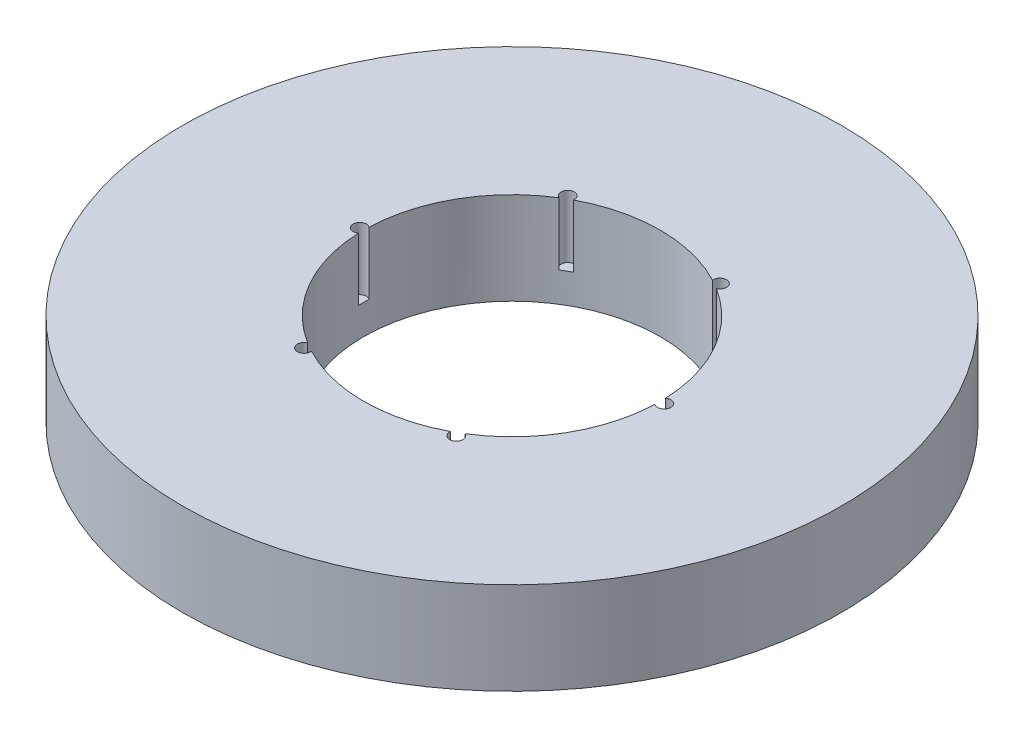
ISO-10303-21;
HEADER;
FILE_DESCRIPTION(('STEP AP214'),'2;1');
FILE_NAME('part.step','',(''),(''),'','','');
FILE_SCHEMA(('AUTOMOTIVE_DESIGN { 1 0 10303 214 1 1 1 1 }'));
ENDSEC;
DATA;
#1=APPLICATION_CONTEXT('core data for automotive mechanical design processes');
#2=APPLICATION_PROTOCOL_DEFINITION('international standard','automotive_design',2000,#1);
#3=PRODUCT_CONTEXT('',#1,'mechanical');
#4=PRODUCT('Part','Part','',(#3));
#5=PRODUCT_RELATED_PRODUCT_CATEGORY('part','',(#4));
#6=PRODUCT_DEFINITION_FORMATION('','',#4);
#7=PRODUCT_DEFINITION_CONTEXT('part definition',#1,'design');
#8=PRODUCT_DEFINITION('design','',#6,#7);
#9=PRODUCT_DEFINITION_SHAPE('','',#8);
#10=(LENGTH_UNIT() NAMED_UNIT(*) SI_UNIT(.MILLI.,.METRE.));
#11=(NAMED_UNIT(*) PLANE_ANGLE_UNIT() SI_UNIT($,.RADIAN.));
#12=(NAMED_UNIT(*) SI_UNIT($,.STERADIAN.) SOLID_ANGLE_UNIT());
#13=UNCERTAINTY_MEASURE_WITH_UNIT(LENGTH_MEASURE(1.E-05),#10,'distance_accuracy_value','');
#14=(GEOMETRIC_REPRESENTATION_CONTEXT(3) GLOBAL_UNCERTAINTY_ASSIGNED_CONTEXT((#13)) GLOBAL_UNIT_ASSIGNED_CONTEXT((#10,
#11,#12)) REPRESENTATION_CONTEXT('',''));
#15=CARTESIAN_POINT('',(0.,0.,0.));
#16=DIRECTION('',(0.,0.,1.));
#17=DIRECTION('',(1.,0.,0.));
#18=AXIS2_PLACEMENT_3D('',#15,#16,#17);
#19=CARTESIAN_POINT('',(0.,28.,0.));
#20=DIRECTION('',(0.,-1.,0.));
#21=DIRECTION('',(0.,0.,-1.));
#22=AXIS2_PLACEMENT_3D('',#19,#20,#21);
#23=CYLINDRICAL_SURFACE('',#22,100.);
#24=CARTESIAN_POINT('',(0.,28.,0.));
#25=DIRECTION('',(0.,1.,0.));
#26=DIRECTION('',(0.,0.,1.));
#27=AXIS2_PLACEMENT_3D('',#24,#25,#26);
#28=CIRCLE('',#27,100.);
#29=CARTESIAN_POINT('',(0.,28.,100.));
#30=VERTEX_POINT('',#29);
#31=EDGE_CURVE('E171',#30,#30,#28,.T.);
#32=ORIENTED_EDGE('',*,*,#31,.F.);
#33=EDGE_LOOP('',(#32));
#34=FACE_BOUND('',#33,.T.);
#35=CARTESIAN_POINT('',(0.,0.,0.));
#36=DIRECTION('',(0.,1.,0.));
#37=DIRECTION('',(0.,0.,1.));
#38=AXIS2_PLACEMENT_3D('',#35,#36,#37);
#39=CIRCLE('',#38,100.);
#40=CARTESIAN_POINT('',(0.,0.,100.));
#41=VERTEX_POINT('',#40);
#42=EDGE_CURVE('E157',#41,#41,#39,.T.);
#43=ORIENTED_EDGE('',*,*,#42,.T.);
#44=EDGE_LOOP('',(#43));
#45=FACE_BOUND('',#44,.T.);
#46=ADVANCED_FACE('F39',(#34,#45),#23,.T.);
#47=CARTESIAN_POINT('',(0.,28.,0.));
#48=DIRECTION('',(0.,1.,0.));
#49=DIRECTION('',(0.,0.,1.));
#50=AXIS2_PLACEMENT_3D('',#47,#48,#49);
#51=PLANE('',#50);
#52=CARTESIAN_POINT('',(-23.097180607275,28.,-40.0054903233939));
#53=DIRECTION('',(0.,1.,0.));
#54=DIRECTION('',(-0.866025403784433,0.,0.50000000000001));
#55=AXIS2_PLACEMENT_3D('',#52,#53,#54);
#56=CIRCLE('',#55,2.01061830867234);
#57=CARTESIAN_POINT('',(-21.1035486993544,28.,-39.7446881016064));
#58=VERTEX_POINT('',#57);
#59=CARTESIAN_POINT('',(-23.8681352118039,28.,-38.1485533344457));
#60=VERTEX_POINT('',#59);
#61=EDGE_CURVE('E214',#58,#60,#56,.T.);
#62=ORIENTED_EDGE('',*,*,#61,.F.);
#63=CARTESIAN_POINT('',(0.,28.,0.));
#64=DIRECTION('',(0.,1.,0.));
#65=DIRECTION('',(0.,0.,1.));
#66=AXIS2_PLACEMENT_3D('',#63,#64,#65);
#67=CIRCLE('',#66,45.);
#68=CARTESIAN_POINT('',(21.1035486993536,28.,-39.7446881016069));
#69=VERTEX_POINT('',#68);
#70=EDGE_CURVE('E272',#69,#58,#67,.T.);
#71=ORIENTED_EDGE('',*,*,#70,.F.);
#72=CARTESIAN_POINT('',(23.0971806072742,28.,-40.0054903233944));
#73=DIRECTION('',(0.,1.,0.));
#74=DIRECTION('',(-0.866025403784443,0.,-0.499999999999992));
#75=AXIS2_PLACEMENT_3D('',#72,#73,#74);
#76=CIRCLE('',#75,2.01061830867234);
#77=CARTESIAN_POINT('',(23.8681352118031,28.,-38.1485533344462));
#78=VERTEX_POINT('',#77);
#79=EDGE_CURVE('E285',#78,#69,#76,.T.);
#80=ORIENTED_EDGE('',*,*,#79,.F.);
#81=CARTESIAN_POINT('',(44.9716839111575,28.,-1.59613476716074));
#82=VERTEX_POINT('',#81);
#83=EDGE_CURVE('E165',#82,#78,#67,.T.);
#84=ORIENTED_EDGE('',*,*,#83,.F.);
#85=CARTESIAN_POINT('',(46.1943612145492,28.,0.));
#86=DIRECTION('',(0.,1.,0.));
#87=DIRECTION('',(0.,0.,-1.));
#88=AXIS2_PLACEMENT_3D('',#85,#86,#87);
#89=CIRCLE('',#88,2.01061830867234);
#90=CARTESIAN_POINT('',(44.9716839111575,28.,1.59613476716074));
#91=VERTEX_POINT('',#90);
#92=EDGE_CURVE('E281',#91,#82,#89,.T.);
#93=ORIENTED_EDGE('',*,*,#92,.F.);
#94=CARTESIAN_POINT('',(23.8681352118037,28.,38.1485533344458));
#95=VERTEX_POINT('',#94);
#96=EDGE_CURVE('E160',#95,#91,#67,.T.);
#97=ORIENTED_EDGE('',*,*,#96,.F.);
#98=CARTESIAN_POINT('',(23.0971806072748,28.,40.005490323394));
#99=DIRECTION('',(0.,1.,0.));
#100=DIRECTION('',(0.866025403784436,0.,-0.500000000000004));
#101=AXIS2_PLACEMENT_3D('',#98,#99,#100);
#102=CIRCLE('',#101,2.01061830867234);
#103=CARTESIAN_POINT('',(21.1035486993542,28.,39.7446881016066));
#104=VERTEX_POINT('',#103);
#105=EDGE_CURVE('E154',#104,#95,#102,.T.);
#106=ORIENTED_EDGE('',*,*,#105,.F.);
#107=CARTESIAN_POINT('',(-21.1035486993539,28.,39.7446881016067));
#108=VERTEX_POINT('',#107);
#109=EDGE_CURVE('E150',#108,#104,#67,.T.);
#110=ORIENTED_EDGE('',*,*,#109,.F.);
#111=CARTESIAN_POINT('',(-23.0971806072745,28.,40.0054903233942));
#112=DIRECTION('',(0.,1.,0.));
#113=DIRECTION('',(0.86602540378444,0.,0.499999999999998));
#114=AXIS2_PLACEMENT_3D('',#111,#112,#113);
#115=CIRCLE('',#114,2.01061830867234);
#116=CARTESIAN_POINT('',(-23.8681352118034,28.,38.148553334446));
#117=VERTEX_POINT('',#116);
#118=EDGE_CURVE('E127',#117,#108,#115,.T.);
#119=ORIENTED_EDGE('',*,*,#118,.F.);
#120=CARTESIAN_POINT('',(-44.9716839111575,28.,1.59613476716074));
#121=VERTEX_POINT('',#120);
#122=EDGE_CURVE('E156',#121,#117,#67,.T.);
#123=ORIENTED_EDGE('',*,*,#122,.F.);
#124=CARTESIAN_POINT('',(-46.1943612145492,28.,0.));
#125=DIRECTION('',(0.,1.,0.));
#126=DIRECTION('',(0.,0.,1.));
#127=AXIS2_PLACEMENT_3D('',#124,#125,#126);
#128=CIRCLE('',#127,2.01061830867234);
#129=CARTESIAN_POINT('',(-44.9716839111575,28.,-1.59613476716074));
#130=VERTEX_POINT('',#129);
#131=EDGE_CURVE('E164',#130,#121,#128,.T.);
#132=ORIENTED_EDGE('',*,*,#131,.F.);
#133=EDGE_CURVE('E159',#60,#130,#67,.T.);
#134=ORIENTED_EDGE('',*,*,#133,.F.);
#135=EDGE_LOOP('',(#62,#71,#80,#84,#93,#97,#106,#110,#119,#123,#132,#134));
#136=FACE_BOUND('',#135,.T.);
#137=ORIENTED_EDGE('',*,*,#31,.T.);
#138=EDGE_LOOP('',(#137));
#139=FACE_BOUND('',#138,.T.);
#140=ADVANCED_FACE('F155',(#136,#139),#51,.T.);
#141=CARTESIAN_POINT('',(0.,0.,0.));
#142=DIRECTION('',(0.,1.,0.));
#143=DIRECTION('',(0.,0.,1.));
#144=AXIS2_PLACEMENT_3D('',#141,#142,#143);
#145=PLANE('',#144);
#146=CARTESIAN_POINT('',(0.,0.,0.));
#147=DIRECTION('',(0.,1.,0.));
#148=DIRECTION('',(0.,0.,1.));
#149=AXIS2_PLACEMENT_3D('',#146,#147,#148);
#150=CIRCLE('',#149,45.);
#151=CARTESIAN_POINT('',(0.,0.,45.));
#152=VERTEX_POINT('',#151);
#153=EDGE_CURVE('E170',#152,#152,#150,.T.);
#154=ORIENTED_EDGE('',*,*,#153,.T.);
#155=EDGE_LOOP('',(#154));
#156=FACE_BOUND('',#155,.T.);
#157=ORIENTED_EDGE('',*,*,#42,.F.);
#158=EDGE_LOOP('',(#157));
#159=FACE_BOUND('',#158,.T.);
#160=ADVANCED_FACE('F232',(#156,#159),#145,.F.);
#161=CARTESIAN_POINT('',(0.,28.,0.));
#162=DIRECTION('',(0.,-1.,0.));
#163=DIRECTION('',(0.,0.,-1.));
#164=AXIS2_PLACEMENT_3D('',#161,#162,#163);
#165=CYLINDRICAL_SURFACE('',#164,45.);
#166=DIRECTION('',(0.,1.,0.));
#167=VECTOR('',#166,1.);
#168=CARTESIAN_POINT('',(-21.1035486993544,18.503757817113,-39.7446881016065));
#169=LINE('',#168,#167);
#170=CARTESIAN_POINT('',(-21.1035486993544,9.00751563422606,-39.7446881016064));
#171=VERTEX_POINT('',#170);
#172=EDGE_CURVE('E11',#171,#58,#169,.T.);
#173=ORIENTED_EDGE('',*,*,#172,.F.);
#174=CARTESIAN_POINT('',(0.,9.00751563422606,0.));
#175=DIRECTION('',(0.,1.,0.));
#176=DIRECTION('',(0.,0.,1.));
#177=AXIS2_PLACEMENT_3D('',#174,#175,#176);
#178=CIRCLE('',#177,45.);
#179=CARTESIAN_POINT('',(-23.8681352118039,9.00751563422606,-38.1485533344457));
#180=VERTEX_POINT('',#179);
#181=EDGE_CURVE('E209',#171,#180,#178,.T.);
#182=ORIENTED_EDGE('',*,*,#181,.T.);
#183=DIRECTION('',(0.,1.,0.));
#184=VECTOR('',#183,1.);
#185=CARTESIAN_POINT('',(-23.8681352118041,18.503757817113,-38.1485533344457));
#186=LINE('',#185,#184);
#187=EDGE_CURVE('E46',#60,#180,#186,.F.);
#188=ORIENTED_EDGE('',*,*,#187,.F.);
#189=ORIENTED_EDGE('',*,*,#133,.T.);
#190=DIRECTION('',(0.,1.,0.));
#191=VECTOR('',#190,1.);
#192=CARTESIAN_POINT('',(-44.9716839111576,18.503757817113,-1.5961347671608));
#193=LINE('',#192,#191);
#194=CARTESIAN_POINT('',(-44.9716839111575,9.00751563422606,-1.59613476716074));
#195=VERTEX_POINT('',#194);
#196=EDGE_CURVE('E185',#195,#130,#193,.T.);
#197=ORIENTED_EDGE('',*,*,#196,.F.);
#198=CARTESIAN_POINT('',(0.,9.00751563422606,0.));
#199=DIRECTION('',(0.,1.,0.));
#200=DIRECTION('',(0.,0.,1.));
#201=AXIS2_PLACEMENT_3D('',#198,#199,#200);
#202=CIRCLE('',#201,45.);
#203=CARTESIAN_POINT('',(-44.9716839111575,9.00751563422606,1.59613476716074));
#204=VERTEX_POINT('',#203);
#205=EDGE_CURVE('E173',#195,#204,#202,.T.);
#206=ORIENTED_EDGE('',*,*,#205,.T.);
#207=DIRECTION('',(0.,1.,0.));
#208=VECTOR('',#207,1.);
#209=CARTESIAN_POINT('',(-44.9716839111576,18.503757817113,1.5961347671608));
#210=LINE('',#209,#208);
#211=EDGE_CURVE('E178',#121,#204,#210,.F.);
#212=ORIENTED_EDGE('',*,*,#211,.F.);
#213=ORIENTED_EDGE('',*,*,#122,.T.);
#214=DIRECTION('',(0.,1.,0.));
#215=VECTOR('',#214,1.);
#216=CARTESIAN_POINT('',(-23.8681352118035,18.503757817113,38.148553334446));
#217=LINE('',#216,#215);
#218=CARTESIAN_POINT('',(-23.8681352118034,9.00751563422606,38.148553334446));
#219=VERTEX_POINT('',#218);
#220=EDGE_CURVE('E132',#219,#117,#217,.T.);
#221=ORIENTED_EDGE('',*,*,#220,.F.);
#222=CARTESIAN_POINT('',(0.,9.00751563422606,0.));
#223=DIRECTION('',(0.,1.,0.));
#224=DIRECTION('',(0.,0.,1.));
#225=AXIS2_PLACEMENT_3D('',#222,#223,#224);
#226=CIRCLE('',#225,45.);
#227=CARTESIAN_POINT('',(-21.1035486993539,9.00751563422606,39.7446881016067));
#228=VERTEX_POINT('',#227);
#229=EDGE_CURVE('E146',#219,#228,#226,.T.);
#230=ORIENTED_EDGE('',*,*,#229,.T.);
#231=DIRECTION('',(0.,1.,0.));
#232=VECTOR('',#231,1.);
#233=CARTESIAN_POINT('',(-21.1035486993539,18.503757817113,39.7446881016068));
#234=LINE('',#233,#232);
#235=EDGE_CURVE('E128',#108,#228,#234,.F.);
#236=ORIENTED_EDGE('',*,*,#235,.F.);
#237=ORIENTED_EDGE('',*,*,#109,.T.);
#238=DIRECTION('',(0.,1.,0.));
#239=VECTOR('',#238,1.);
#240=CARTESIAN_POINT('',(21.1035486993542,18.503757817113,39.7446881016065));
#241=LINE('',#240,#239);
#242=CARTESIAN_POINT('',(21.1035486993542,9.00751563422606,39.7446881016066));
#243=VERTEX_POINT('',#242);
#244=EDGE_CURVE('E192',#243,#104,#241,.T.);
#245=ORIENTED_EDGE('',*,*,#244,.F.);
#246=CARTESIAN_POINT('',(0.,9.00751563422606,0.));
#247=DIRECTION('',(0.,1.,0.));
#248=DIRECTION('',(0.,0.,1.));
#249=AXIS2_PLACEMENT_3D('',#246,#247,#248);
#250=CIRCLE('',#249,45.);
#251=CARTESIAN_POINT('',(23.8681352118037,9.00751563422606,38.1485533344458));
#252=VERTEX_POINT('',#251);
#253=EDGE_CURVE('E190',#243,#252,#250,.T.);
#254=ORIENTED_EDGE('',*,*,#253,.T.);
#255=DIRECTION('',(0.,1.,0.));
#256=VECTOR('',#255,1.);
#257=CARTESIAN_POINT('',(23.8681352118036,18.503757817113,38.1485533344458));
#258=LINE('',#257,#256);
#259=EDGE_CURVE('E189',#95,#252,#258,.F.);
#260=ORIENTED_EDGE('',*,*,#259,.F.);
#261=ORIENTED_EDGE('',*,*,#96,.T.);
#262=DIRECTION('',(0.,1.,0.));
#263=VECTOR('',#262,1.);
#264=CARTESIAN_POINT('',(44.9716839111576,18.503757817113,1.5961347671608));
#265=LINE('',#264,#263);
#266=CARTESIAN_POINT('',(44.9716839111575,9.00751563422606,1.59613476716074));
#267=VERTEX_POINT('',#266);
#268=EDGE_CURVE('E203',#267,#91,#265,.T.);
#269=ORIENTED_EDGE('',*,*,#268,.F.);
#270=CARTESIAN_POINT('',(0.,9.00751563422606,0.));
#271=DIRECTION('',(0.,1.,0.));
#272=DIRECTION('',(0.,0.,1.));
#273=AXIS2_PLACEMENT_3D('',#270,#271,#272);
#274=CIRCLE('',#273,45.);
#275=CARTESIAN_POINT('',(44.9716839111575,9.00751563422606,-1.59613476716074));
#276=VERTEX_POINT('',#275);
#277=EDGE_CURVE('E194',#267,#276,#274,.T.);
#278=ORIENTED_EDGE('',*,*,#277,.T.);
#279=DIRECTION('',(0.,1.,0.));
#280=VECTOR('',#279,1.);
#281=CARTESIAN_POINT('',(44.9716839111576,18.503757817113,-1.5961347671608));
#282=LINE('',#281,#280);
#283=EDGE_CURVE('E196',#82,#276,#282,.F.);
#284=ORIENTED_EDGE('',*,*,#283,.F.);
#285=ORIENTED_EDGE('',*,*,#83,.T.);
#286=DIRECTION('',(0.,1.,0.));
#287=VECTOR('',#286,1.);
#288=CARTESIAN_POINT('',(23.8681352118033,18.503757817113,-38.1485533344462));
#289=LINE('',#288,#287);
#290=CARTESIAN_POINT('',(23.8681352118031,9.00751563422606,-38.1485533344462));
#291=VERTEX_POINT('',#290);
#292=EDGE_CURVE('E208',#291,#78,#289,.T.);
#293=ORIENTED_EDGE('',*,*,#292,.F.);
#294=CARTESIAN_POINT('',(0.,9.00751563422606,0.));
#295=DIRECTION('',(0.,1.,0.));
#296=DIRECTION('',(0.,0.,1.));
#297=AXIS2_PLACEMENT_3D('',#294,#295,#296);
#298=CIRCLE('',#297,45.);
#299=CARTESIAN_POINT('',(21.1035486993536,9.00751563422606,-39.7446881016069));
#300=VERTEX_POINT('',#299);
#301=EDGE_CURVE('E201',#291,#300,#298,.T.);
#302=ORIENTED_EDGE('',*,*,#301,.T.);
#303=DIRECTION('',(0.,1.,0.));
#304=VECTOR('',#303,1.);
#305=CARTESIAN_POINT('',(21.1035486993536,18.503757817113,-39.744688101607));
#306=LINE('',#305,#304);
#307=EDGE_CURVE('E206',#69,#300,#306,.F.);
#308=ORIENTED_EDGE('',*,*,#307,.F.);
#309=ORIENTED_EDGE('',*,*,#70,.T.);
#310=EDGE_LOOP('',(#173,#182,#188,#189,#197,#206,#212,#213,#221,#230,#236,#237,#245,#254,#260,
#261,#269,#278,#284,#285,#293,#302,#308,#309));
#311=FACE_BOUND('',#310,.T.);
#312=ORIENTED_EDGE('',*,*,#153,.F.);
#313=EDGE_LOOP('',(#312));
#314=FACE_BOUND('',#313,.T.);
#315=ADVANCED_FACE('F145',(#311,#314),#165,.F.);
#316=CARTESIAN_POINT('',(-46.1943612145492,9.00751563422606,0.));
#317=DIRECTION('',(0.,1.,0.));
#318=DIRECTION('',(0.,0.,1.));
#319=AXIS2_PLACEMENT_3D('',#316,#317,#318);
#320=CYLINDRICAL_SURFACE('',#319,2.01061830867234);
#321=ORIENTED_EDGE('',*,*,#196,.T.);
#322=ORIENTED_EDGE('',*,*,#131,.T.);
#323=ORIENTED_EDGE('',*,*,#211,.T.);
#324=CARTESIAN_POINT('',(-46.1943612145492,9.00751563422606,0.));
#325=DIRECTION('',(0.,1.,0.));
#326=DIRECTION('',(0.,0.,1.));
#327=AXIS2_PLACEMENT_3D('',#324,#325,#326);
#328=CIRCLE('',#327,2.01061830867234);
#329=EDGE_CURVE('E168',#195,#204,#328,.T.);
#330=ORIENTED_EDGE('',*,*,#329,.F.);
#331=EDGE_LOOP('',(#321,#322,#323,#330));
#332=FACE_BOUND('',#331,.T.);
#333=ADVANCED_FACE('F243',(#332),#320,.F.);
#334=CARTESIAN_POINT('',(-46.1943612145492,9.00751563422606,0.));
#335=DIRECTION('',(0.,1.,0.));
#336=DIRECTION('',(0.,0.,1.));
#337=AXIS2_PLACEMENT_3D('',#334,#335,#336);
#338=PLANE('',#337);
#339=ORIENTED_EDGE('',*,*,#329,.T.);
#340=ORIENTED_EDGE('',*,*,#205,.F.);
#341=EDGE_LOOP('',(#339,#340));
#342=FACE_BOUND('',#341,.T.);
#343=ADVANCED_FACE('F247',(#342),#338,.T.);
#344=CARTESIAN_POINT('',(-23.0971806072745,9.00751563422606,40.0054903233942));
#345=DIRECTION('',(0.,1.,0.));
#346=DIRECTION('',(0.,0.,1.));
#347=AXIS2_PLACEMENT_3D('',#344,#345,#346);
#348=CYLINDRICAL_SURFACE('',#347,2.01061830867234);
#349=ORIENTED_EDGE('',*,*,#220,.T.);
#350=ORIENTED_EDGE('',*,*,#118,.T.);
#351=ORIENTED_EDGE('',*,*,#235,.T.);
#352=CARTESIAN_POINT('',(-23.0971806072745,9.00751563422606,40.0054903233942));
#353=DIRECTION('',(0.,1.,0.));
#354=DIRECTION('',(0.86602540378444,0.,0.499999999999998));
#355=AXIS2_PLACEMENT_3D('',#352,#353,#354);
#356=CIRCLE('',#355,2.01061830867234);
#357=EDGE_CURVE('E137',#219,#228,#356,.T.);
#358=ORIENTED_EDGE('',*,*,#357,.F.);
#359=EDGE_LOOP('',(#349,#350,#351,#358));
#360=FACE_BOUND('',#359,.T.);
#361=ADVANCED_FACE('F126',(#360),#348,.F.);
#362=CARTESIAN_POINT('',(-23.0971806072745,9.00751563422606,40.0054903233942));
#363=DIRECTION('',(0.,1.,0.));
#364=DIRECTION('',(0.86602540378444,0.,0.499999999999998));
#365=AXIS2_PLACEMENT_3D('',#362,#363,#364);
#366=PLANE('',#365);
#367=ORIENTED_EDGE('',*,*,#357,.T.);
#368=ORIENTED_EDGE('',*,*,#229,.F.);
#369=EDGE_LOOP('',(#367,#368));
#370=FACE_BOUND('',#369,.T.);
#371=ADVANCED_FACE('F254',(#370),#366,.T.);
#372=CARTESIAN_POINT('',(23.0971806072748,9.00751563422606,40.005490323394));
#373=DIRECTION('',(0.,1.,0.));
#374=DIRECTION('',(0.,0.,1.));
#375=AXIS2_PLACEMENT_3D('',#372,#373,#374);
#376=CYLINDRICAL_SURFACE('',#375,2.01061830867234);
#377=ORIENTED_EDGE('',*,*,#244,.T.);
#378=ORIENTED_EDGE('',*,*,#105,.T.);
#379=ORIENTED_EDGE('',*,*,#259,.T.);
#380=CARTESIAN_POINT('',(23.0971806072748,9.00751563422606,40.005490323394));
#381=DIRECTION('',(0.,1.,0.));
#382=DIRECTION('',(0.866025403784436,0.,-0.500000000000004));
#383=AXIS2_PLACEMENT_3D('',#380,#381,#382);
#384=CIRCLE('',#383,2.01061830867234);
#385=EDGE_CURVE('E138',#243,#252,#384,.T.);
#386=ORIENTED_EDGE('',*,*,#385,.F.);
#387=EDGE_LOOP('',(#377,#378,#379,#386));
#388=FACE_BOUND('',#387,.T.);
#389=ADVANCED_FACE('F260',(#388),#376,.F.);
#390=CARTESIAN_POINT('',(23.0971806072748,9.00751563422606,40.005490323394));
#391=DIRECTION('',(0.,1.,0.));
#392=DIRECTION('',(0.866025403784436,0.,-0.500000000000004));
#393=AXIS2_PLACEMENT_3D('',#390,#391,#392);
#394=PLANE('',#393);
#395=ORIENTED_EDGE('',*,*,#385,.T.);
#396=ORIENTED_EDGE('',*,*,#253,.F.);
#397=EDGE_LOOP('',(#395,#396));
#398=FACE_BOUND('',#397,.T.);
#399=ADVANCED_FACE('F265',(#398),#394,.T.);
#400=CARTESIAN_POINT('',(46.1943612145492,9.00751563422606,0.));
#401=DIRECTION('',(0.,1.,0.));
#402=DIRECTION('',(0.,0.,1.));
#403=AXIS2_PLACEMENT_3D('',#400,#401,#402);
#404=CYLINDRICAL_SURFACE('',#403,2.01061830867234);
#405=ORIENTED_EDGE('',*,*,#268,.T.);
#406=ORIENTED_EDGE('',*,*,#92,.T.);
#407=ORIENTED_EDGE('',*,*,#283,.T.);
#408=CARTESIAN_POINT('',(46.1943612145492,9.00751563422606,0.));
#409=DIRECTION('',(0.,1.,0.));
#410=DIRECTION('',(0.,0.,-1.));
#411=AXIS2_PLACEMENT_3D('',#408,#409,#410);
#412=CIRCLE('',#411,2.01061830867234);
#413=EDGE_CURVE('E287',#267,#276,#412,.T.);
#414=ORIENTED_EDGE('',*,*,#413,.F.);
#415=EDGE_LOOP('',(#405,#406,#407,#414));
#416=FACE_BOUND('',#415,.T.);
#417=ADVANCED_FACE('F300',(#416),#404,.F.);
#418=CARTESIAN_POINT('',(46.1943612145492,9.00751563422606,0.));
#419=DIRECTION('',(0.,1.,0.));
#420=DIRECTION('',(0.,0.,-1.));
#421=AXIS2_PLACEMENT_3D('',#418,#419,#420);
#422=PLANE('',#421);
#423=ORIENTED_EDGE('',*,*,#413,.T.);
#424=ORIENTED_EDGE('',*,*,#277,.F.);
#425=EDGE_LOOP('',(#423,#424));
#426=FACE_BOUND('',#425,.T.);
#427=ADVANCED_FACE('F298',(#426),#422,.T.);
#428=CARTESIAN_POINT('',(23.0971806072742,9.00751563422606,-40.0054903233944));
#429=DIRECTION('',(0.,1.,0.));
#430=DIRECTION('',(0.,0.,1.));
#431=AXIS2_PLACEMENT_3D('',#428,#429,#430);
#432=CYLINDRICAL_SURFACE('',#431,2.01061830867234);
#433=ORIENTED_EDGE('',*,*,#292,.T.);
#434=ORIENTED_EDGE('',*,*,#79,.T.);
#435=ORIENTED_EDGE('',*,*,#307,.T.);
#436=CARTESIAN_POINT('',(23.0971806072742,9.00751563422606,-40.0054903233944));
#437=DIRECTION('',(0.,1.,0.));
#438=DIRECTION('',(-0.866025403784443,0.,-0.499999999999992));
#439=AXIS2_PLACEMENT_3D('',#436,#437,#438);
#440=CIRCLE('',#439,2.01061830867234);
#441=EDGE_CURVE('E56',#291,#300,#440,.T.);
#442=ORIENTED_EDGE('',*,*,#441,.F.);
#443=EDGE_LOOP('',(#433,#434,#435,#442));
#444=FACE_BOUND('',#443,.T.);
#445=ADVANCED_FACE('F301',(#444),#432,.F.);
#446=CARTESIAN_POINT('',(23.0971806072742,9.00751563422606,-40.0054903233944));
#447=DIRECTION('',(0.,1.,0.));
#448=DIRECTION('',(-0.866025403784443,0.,-0.499999999999992));
#449=AXIS2_PLACEMENT_3D('',#446,#447,#448);
#450=PLANE('',#449);
#451=ORIENTED_EDGE('',*,*,#441,.T.);
#452=ORIENTED_EDGE('',*,*,#301,.F.);
#453=EDGE_LOOP('',(#451,#452));
#454=FACE_BOUND('',#453,.T.);
#455=ADVANCED_FACE('F221',(#454),#450,.T.);
#456=CARTESIAN_POINT('',(-23.097180607275,9.00751563422606,-40.0054903233939));
#457=DIRECTION('',(0.,1.,0.));
#458=DIRECTION('',(0.,0.,1.));
#459=AXIS2_PLACEMENT_3D('',#456,#457,#458);
#460=CYLINDRICAL_SURFACE('',#459,2.01061830867234);
#461=ORIENTED_EDGE('',*,*,#172,.T.);
#462=ORIENTED_EDGE('',*,*,#61,.T.);
#463=ORIENTED_EDGE('',*,*,#187,.T.);
#464=CARTESIAN_POINT('',(-23.097180607275,9.00751563422606,-40.0054903233939));
#465=DIRECTION('',(0.,1.,0.));
#466=DIRECTION('',(-0.866025403784433,0.,0.50000000000001));
#467=AXIS2_PLACEMENT_3D('',#464,#465,#466);
#468=CIRCLE('',#467,2.01061830867234);
#469=EDGE_CURVE('E55',#171,#180,#468,.T.);
#470=ORIENTED_EDGE('',*,*,#469,.F.);
#471=EDGE_LOOP('',(#461,#462,#463,#470));
#472=FACE_BOUND('',#471,.T.);
#473=ADVANCED_FACE('F212',(#472),#460,.F.);
#474=CARTESIAN_POINT('',(-23.097180607275,9.00751563422606,-40.0054903233939));
#475=DIRECTION('',(0.,1.,0.));
#476=DIRECTION('',(-0.866025403784433,0.,0.50000000000001));
#477=AXIS2_PLACEMENT_3D('',#474,#475,#476);
#478=PLANE('',#477);
#479=ORIENTED_EDGE('',*,*,#469,.T.);
#480=ORIENTED_EDGE('',*,*,#181,.F.);
#481=EDGE_LOOP('',(#479,#480));
#482=FACE_BOUND('',#481,.T.);
#483=ADVANCED_FACE('F217',(#482),#478,.T.);
#484=CLOSED_SHELL('',(#46,#140,#160,#315,#333,#343,#361,#371,#389,#399,#417,#427,#445,#455,#473,#483));
#485=MANIFOLD_SOLID_BREP('B2',#484);
#486=ADVANCED_BREP_SHAPE_REPRESENTATION('',(#18,#485),#14);
#487=SHAPE_DEFINITION_REPRESENTATION(#9,#486);
ENDSEC;
END-ISO-10303-21;
